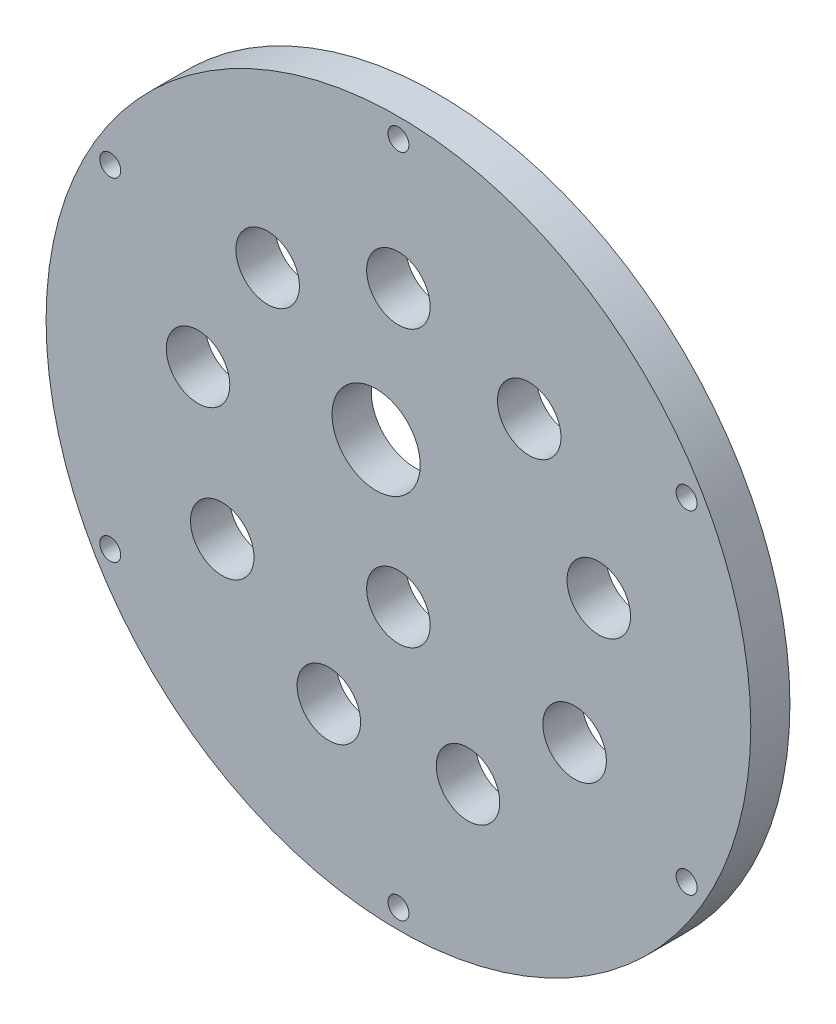
ISO-10303-21;
HEADER;
FILE_DESCRIPTION(('STEP AP214'),'2;1');
FILE_NAME('part.step','',(''),(''),'','','');
FILE_SCHEMA(('AUTOMOTIVE_DESIGN { 1 0 10303 214 1 1 1 1 }'));
ENDSEC;
DATA;
#1=APPLICATION_CONTEXT('core data for automotive mechanical design processes');
#2=APPLICATION_PROTOCOL_DEFINITION('international standard','automotive_design',2000,#1);
#3=PRODUCT_CONTEXT('',#1,'mechanical');
#4=PRODUCT('Part','Part','',(#3));
#5=PRODUCT_RELATED_PRODUCT_CATEGORY('part','',(#4));
#6=PRODUCT_DEFINITION_FORMATION('','',#4);
#7=PRODUCT_DEFINITION_CONTEXT('part definition',#1,'design');
#8=PRODUCT_DEFINITION('design','',#6,#7);
#9=PRODUCT_DEFINITION_SHAPE('','',#8);
#10=(LENGTH_UNIT() NAMED_UNIT(*) SI_UNIT(.MILLI.,.METRE.));
#11=(NAMED_UNIT(*) PLANE_ANGLE_UNIT() SI_UNIT($,.RADIAN.));
#12=(NAMED_UNIT(*) SI_UNIT($,.STERADIAN.) SOLID_ANGLE_UNIT());
#13=UNCERTAINTY_MEASURE_WITH_UNIT(LENGTH_MEASURE(1.E-05),#10,'distance_accuracy_value','');
#14=(GEOMETRIC_REPRESENTATION_CONTEXT(3) GLOBAL_UNCERTAINTY_ASSIGNED_CONTEXT((#13)) GLOBAL_UNIT_ASSIGNED_CONTEXT((#10,
#11,#12)) REPRESENTATION_CONTEXT('',''));
#15=CARTESIAN_POINT('',(0.,0.,0.));
#16=DIRECTION('',(0.,0.,1.));
#17=DIRECTION('',(1.,0.,0.));
#18=AXIS2_PLACEMENT_3D('',#15,#16,#17);
#19=CARTESIAN_POINT('',(0.,0.,6.35));
#20=DIRECTION('',(0.,0.,-1.));
#21=DIRECTION('',(-1.,0.,0.));
#22=AXIS2_PLACEMENT_3D('',#19,#20,#21);
#23=CYLINDRICAL_SURFACE('',#22,57.15);
#24=CARTESIAN_POINT('',(0.,0.,6.35));
#25=DIRECTION('',(0.,0.,1.));
#26=DIRECTION('',(1.,0.,0.));
#27=AXIS2_PLACEMENT_3D('',#24,#25,#26);
#28=CIRCLE('',#27,57.15);
#29=CARTESIAN_POINT('',(57.15,0.,6.35));
#30=VERTEX_POINT('',#29);
#31=EDGE_CURVE('E10',#30,#30,#28,.T.);
#32=ORIENTED_EDGE('',*,*,#31,.F.);
#33=EDGE_LOOP('',(#32));
#34=FACE_BOUND('',#33,.T.);
#35=CARTESIAN_POINT('',(0.,0.,0.));
#36=DIRECTION('',(0.,0.,1.));
#37=DIRECTION('',(1.,0.,0.));
#38=AXIS2_PLACEMENT_3D('',#35,#36,#37);
#39=CIRCLE('',#38,57.15);
#40=CARTESIAN_POINT('',(57.15,0.,0.));
#41=VERTEX_POINT('',#40);
#42=EDGE_CURVE('E43',#41,#41,#39,.T.);
#43=ORIENTED_EDGE('',*,*,#42,.T.);
#44=EDGE_LOOP('',(#43));
#45=FACE_BOUND('',#44,.T.);
#46=ADVANCED_FACE('F40',(#34,#45),#23,.T.);
#47=CARTESIAN_POINT('',(0.,0.,6.35));
#48=DIRECTION('',(0.,0.,1.));
#49=DIRECTION('',(1.,0.,0.));
#50=AXIS2_PLACEMENT_3D('',#47,#48,#49);
#51=PLANE('',#50);
#52=CARTESIAN_POINT('',(-3.61618795792426,9.93539475890081,6.35));
#53=DIRECTION('',(0.,0.,1.));
#54=DIRECTION('',(1.,0.,0.));
#55=AXIS2_PLACEMENT_3D('',#52,#53,#54);
#56=CIRCLE('',#55,7.15);
#57=CARTESIAN_POINT('',(3.53381204207574,9.93539475890081,6.35));
#58=VERTEX_POINT('',#57);
#59=EDGE_CURVE('E148',#58,#58,#56,.T.);
#60=ORIENTED_EDGE('',*,*,#59,.F.);
#61=EDGE_LOOP('',(#60));
#62=FACE_BOUND('',#61,.T.);
#63=CARTESIAN_POINT('',(0.,-11.7529526489722,6.35));
#64=DIRECTION('',(0.,0.,1.));
#65=DIRECTION('',(1.,0.,0.));
#66=AXIS2_PLACEMENT_3D('',#63,#64,#65);
#67=CIRCLE('',#66,5.15);
#68=CARTESIAN_POINT('',(5.14999999999992,-11.7529526489722,6.35));
#69=VERTEX_POINT('',#68);
#70=EDGE_CURVE('E142',#69,#69,#67,.T.);
#71=ORIENTED_EDGE('',*,*,#70,.F.);
#72=EDGE_LOOP('',(#71));
#73=FACE_BOUND('',#72,.T.);
#74=CARTESIAN_POINT('',(-46.7437211692648,26.9875000000005,6.35));
#75=DIRECTION('',(0.,0.,1.));
#76=DIRECTION('',(0.50000000000001,0.866025403784433,0.));
#77=AXIS2_PLACEMENT_3D('',#74,#75,#76);
#78=CIRCLE('',#77,1.7);
#79=CARTESIAN_POINT('',(-45.8937211692647,28.4597431864341,6.35));
#80=VERTEX_POINT('',#79);
#81=EDGE_CURVE('E118',#80,#80,#78,.T.);
#82=ORIENTED_EDGE('',*,*,#81,.F.);
#83=EDGE_LOOP('',(#82));
#84=FACE_BOUND('',#83,.T.);
#85=CARTESIAN_POINT('',(-46.7437211692653,-26.9874999999996,6.35));
#86=DIRECTION('',(0.,0.,1.));
#87=DIRECTION('',(-0.499999999999992,0.866025403784443,0.));
#88=AXIS2_PLACEMENT_3D('',#85,#86,#87);
#89=CIRCLE('',#88,1.7);
#90=CARTESIAN_POINT('',(-47.5937211692653,-25.515256813566,6.35));
#91=VERTEX_POINT('',#90);
#92=EDGE_CURVE('E125',#91,#91,#89,.T.);
#93=ORIENTED_EDGE('',*,*,#92,.F.);
#94=EDGE_LOOP('',(#93));
#95=FACE_BOUND('',#94,.T.);
#96=CARTESIAN_POINT('',(0.,-53.975,6.35));
#97=DIRECTION('',(0.,0.,1.));
#98=DIRECTION('',(-1.,0.,0.));
#99=AXIS2_PLACEMENT_3D('',#96,#97,#98);
#100=CIRCLE('',#99,1.7);
#101=CARTESIAN_POINT('',(-1.7,-53.975,6.35));
#102=VERTEX_POINT('',#101);
#103=EDGE_CURVE('E131',#102,#102,#100,.T.);
#104=ORIENTED_EDGE('',*,*,#103,.F.);
#105=EDGE_LOOP('',(#104));
#106=FACE_BOUND('',#105,.T.);
#107=CARTESIAN_POINT('',(46.743721169265,-26.9875000000002,6.35));
#108=DIRECTION('',(0.,0.,1.));
#109=DIRECTION('',(-0.500000000000004,-0.866025403784436,0.));
#110=AXIS2_PLACEMENT_3D('',#107,#108,#109);
#111=CIRCLE('',#110,1.7);
#112=CARTESIAN_POINT('',(45.893721169265,-28.4597431864338,6.35));
#113=VERTEX_POINT('',#112);
#114=EDGE_CURVE('E137',#113,#113,#111,.T.);
#115=ORIENTED_EDGE('',*,*,#114,.F.);
#116=EDGE_LOOP('',(#115));
#117=FACE_BOUND('',#116,.T.);
#118=CARTESIAN_POINT('',(46.7437211692651,26.9874999999999,6.35));
#119=DIRECTION('',(0.,0.,1.));
#120=DIRECTION('',(0.499999999999998,-0.86602540378444,0.));
#121=AXIS2_PLACEMENT_3D('',#118,#119,#120);
#122=CIRCLE('',#121,1.7);
#123=CARTESIAN_POINT('',(47.5937211692651,25.5152568135663,6.35));
#124=VERTEX_POINT('',#123);
#125=EDGE_CURVE('E112',#124,#124,#122,.T.);
#126=ORIENTED_EDGE('',*,*,#125,.F.);
#127=EDGE_LOOP('',(#126));
#128=FACE_BOUND('',#127,.T.);
#129=CARTESIAN_POINT('',(0.,53.975,6.35));
#130=DIRECTION('',(0.,0.,1.));
#131=DIRECTION('',(1.,0.,0.));
#132=AXIS2_PLACEMENT_3D('',#129,#130,#131);
#133=CIRCLE('',#132,1.7);
#134=CARTESIAN_POINT('',(1.7,53.975,6.35));
#135=VERTEX_POINT('',#134);
#136=EDGE_CURVE('E106',#135,#135,#133,.T.);
#137=ORIENTED_EDGE('',*,*,#136,.F.);
#138=EDGE_LOOP('',(#137));
#139=FACE_BOUND('',#138,.T.);
#140=CARTESIAN_POINT('',(32.4986558494029,5.7303898630086,6.35));
#141=DIRECTION('',(0.,0.,1.));
#142=DIRECTION('',(0.173648177666927,-0.984807753012209,0.));
#143=AXIS2_PLACEMENT_3D('',#140,#141,#142);
#144=CIRCLE('',#143,5.15);
#145=CARTESIAN_POINT('',(33.3929439643876,0.658629934995728,6.35));
#146=VERTEX_POINT('',#145);
#147=EDGE_CURVE('E83',#146,#146,#144,.T.);
#148=ORIENTED_EDGE('',*,*,#147,.F.);
#149=EDGE_LOOP('',(#148));
#150=FACE_BOUND('',#149,.T.);
#151=CARTESIAN_POINT('',(28.5788383248864,-16.5000000000001,6.35));
#152=DIRECTION('',(0.,0.,1.));
#153=DIRECTION('',(-0.500000000000004,-0.866025403784436,0.));
#154=AXIS2_PLACEMENT_3D('',#151,#152,#153);
#155=CIRCLE('',#154,5.15);
#156=CARTESIAN_POINT('',(26.0038383248864,-20.96003082949,6.35));
#157=VERTEX_POINT('',#156);
#158=EDGE_CURVE('E77',#157,#157,#155,.T.);
#159=ORIENTED_EDGE('',*,*,#158,.F.);
#160=EDGE_LOOP('',(#159));
#161=FACE_BOUND('',#160,.T.);
#162=CARTESIAN_POINT('',(11.2866647297469,-31.0098564859351,6.35));
#163=DIRECTION('',(0.,0.,1.));
#164=DIRECTION('',(-0.939692620785911,-0.342020143325663,0.));
#165=AXIS2_PLACEMENT_3D('',#162,#163,#164);
#166=CIRCLE('',#165,5.15);
#167=CARTESIAN_POINT('',(6.44724773269944,-32.7712602240622,6.35));
#168=VERTEX_POINT('',#167);
#169=EDGE_CURVE('E71',#168,#168,#166,.T.);
#170=ORIENTED_EDGE('',*,*,#169,.F.);
#171=EDGE_LOOP('',(#170));
#172=FACE_BOUND('',#171,.T.);
#173=CARTESIAN_POINT('',(-11.2866647297473,-31.0098564859349,6.35));
#174=DIRECTION('',(0.,0.,1.));
#175=DIRECTION('',(-0.939692620785906,0.342020143325676,0.));
#176=AXIS2_PLACEMENT_3D('',#173,#174,#175);
#177=CIRCLE('',#176,5.15);
#178=CARTESIAN_POINT('',(-16.1260817267947,-29.2484527478077,6.35));
#179=VERTEX_POINT('',#178);
#180=EDGE_CURVE('E64',#179,#179,#177,.T.);
#181=ORIENTED_EDGE('',*,*,#180,.F.);
#182=EDGE_LOOP('',(#181));
#183=FACE_BOUND('',#182,.T.);
#184=CARTESIAN_POINT('',(-28.5788383248866,-16.4999999999997,6.35));
#185=DIRECTION('',(0.,0.,1.));
#186=DIRECTION('',(-0.499999999999992,0.866025403784443,0.));
#187=AXIS2_PLACEMENT_3D('',#184,#185,#186);
#188=CIRCLE('',#187,5.15);
#189=CARTESIAN_POINT('',(-31.1538383248866,-12.0399691705099,6.35));
#190=VERTEX_POINT('',#189);
#191=EDGE_CURVE('E101',#190,#190,#188,.T.);
#192=ORIENTED_EDGE('',*,*,#191,.F.);
#193=EDGE_LOOP('',(#192));
#194=FACE_BOUND('',#193,.T.);
#195=CARTESIAN_POINT('',(-32.4986558494028,5.73038986300904,6.35));
#196=DIRECTION('',(0.,0.,1.));
#197=DIRECTION('',(0.17364817766694,0.984807753012206,0.));
#198=AXIS2_PLACEMENT_3D('',#195,#196,#197);
#199=CIRCLE('',#198,5.15);
#200=CARTESIAN_POINT('',(-31.6043677344181,10.8021497910219,6.35));
#201=VERTEX_POINT('',#200);
#202=EDGE_CURVE('E95',#201,#201,#199,.T.);
#203=ORIENTED_EDGE('',*,*,#202,.F.);
#204=EDGE_LOOP('',(#203));
#205=FACE_BOUND('',#204,.T.);
#206=CARTESIAN_POINT('',(-21.2119911196555,25.2794666229265,6.35));
#207=DIRECTION('',(0.,0.,1.));
#208=DIRECTION('',(0.766044443118986,0.64278760968653,0.));
#209=AXIS2_PLACEMENT_3D('',#206,#207,#208);
#210=CIRCLE('',#209,5.15);
#211=CARTESIAN_POINT('',(-17.2668622375927,28.5898228128122,6.35));
#212=VERTEX_POINT('',#211);
#213=EDGE_CURVE('E88',#212,#212,#210,.T.);
#214=ORIENTED_EDGE('',*,*,#213,.F.);
#215=EDGE_LOOP('',(#214));
#216=FACE_BOUND('',#215,.T.);
#217=CARTESIAN_POINT('',(21.2119911196558,25.2794666229263,6.35));
#218=DIRECTION('',(0.,0.,1.));
#219=DIRECTION('',(0.766044443118977,-0.642787609686541,0.));
#220=AXIS2_PLACEMENT_3D('',#217,#218,#219);
#221=CIRCLE('',#220,5.15);
#222=CARTESIAN_POINT('',(25.1571200017186,21.9691104330406,6.35));
#223=VERTEX_POINT('',#222);
#224=EDGE_CURVE('E58',#223,#223,#221,.T.);
#225=ORIENTED_EDGE('',*,*,#224,.F.);
#226=EDGE_LOOP('',(#225));
#227=FACE_BOUND('',#226,.T.);
#228=CARTESIAN_POINT('',(0.,33.,6.35));
#229=DIRECTION('',(0.,0.,1.));
#230=DIRECTION('',(1.,0.,0.));
#231=AXIS2_PLACEMENT_3D('',#228,#229,#230);
#232=CIRCLE('',#231,5.15);
#233=CARTESIAN_POINT('',(5.15,33.,6.35));
#234=VERTEX_POINT('',#233);
#235=EDGE_CURVE('E52',#234,#234,#232,.T.);
#236=ORIENTED_EDGE('',*,*,#235,.F.);
#237=EDGE_LOOP('',(#236));
#238=FACE_BOUND('',#237,.T.);
#239=ORIENTED_EDGE('',*,*,#31,.T.);
#240=EDGE_LOOP('',(#239));
#241=FACE_BOUND('',#240,.T.);
#242=ADVANCED_FACE('F164',(#62,#73,#84,#95,#106,#117,#128,#139,#150,#161,#172,#183,#194,#205,
#216,#227,#238,#241),#51,.T.);
#243=CARTESIAN_POINT('',(0.,0.,0.));
#244=DIRECTION('',(0.,0.,1.));
#245=DIRECTION('',(1.,0.,0.));
#246=AXIS2_PLACEMENT_3D('',#243,#244,#245);
#247=PLANE('',#246);
#248=CARTESIAN_POINT('',(-3.61618795792426,9.93539475890081,0.));
#249=DIRECTION('',(0.,0.,1.));
#250=DIRECTION('',(1.,0.,0.));
#251=AXIS2_PLACEMENT_3D('',#248,#249,#250);
#252=CIRCLE('',#251,7.15);
#253=CARTESIAN_POINT('',(3.53381204207574,9.93539475890081,0.));
#254=VERTEX_POINT('',#253);
#255=EDGE_CURVE('E122',#254,#254,#252,.T.);
#256=ORIENTED_EDGE('',*,*,#255,.T.);
#257=EDGE_LOOP('',(#256));
#258=FACE_BOUND('',#257,.T.);
#259=CARTESIAN_POINT('',(0.,-11.7529526489722,0.));
#260=DIRECTION('',(0.,0.,1.));
#261=DIRECTION('',(1.,0.,0.));
#262=AXIS2_PLACEMENT_3D('',#259,#260,#261);
#263=CIRCLE('',#262,5.15);
#264=CARTESIAN_POINT('',(5.14999999999992,-11.7529526489722,0.));
#265=VERTEX_POINT('',#264);
#266=EDGE_CURVE('E145',#265,#265,#263,.T.);
#267=ORIENTED_EDGE('',*,*,#266,.T.);
#268=EDGE_LOOP('',(#267));
#269=FACE_BOUND('',#268,.T.);
#270=CARTESIAN_POINT('',(-46.7437211692648,26.9875000000005,0.));
#271=DIRECTION('',(0.,0.,1.));
#272=DIRECTION('',(0.50000000000001,0.866025403784433,0.));
#273=AXIS2_PLACEMENT_3D('',#270,#271,#272);
#274=CIRCLE('',#273,1.7);
#275=CARTESIAN_POINT('',(-45.8937211692647,28.4597431864341,0.));
#276=VERTEX_POINT('',#275);
#277=EDGE_CURVE('E121',#276,#276,#274,.T.);
#278=ORIENTED_EDGE('',*,*,#277,.T.);
#279=EDGE_LOOP('',(#278));
#280=FACE_BOUND('',#279,.T.);
#281=CARTESIAN_POINT('',(-46.7437211692653,-26.9874999999996,0.));
#282=DIRECTION('',(0.,0.,1.));
#283=DIRECTION('',(-0.499999999999992,0.866025403784443,0.));
#284=AXIS2_PLACEMENT_3D('',#281,#282,#283);
#285=CIRCLE('',#284,1.7);
#286=CARTESIAN_POINT('',(-47.5937211692653,-25.515256813566,0.));
#287=VERTEX_POINT('',#286);
#288=EDGE_CURVE('E128',#287,#287,#285,.T.);
#289=ORIENTED_EDGE('',*,*,#288,.T.);
#290=EDGE_LOOP('',(#289));
#291=FACE_BOUND('',#290,.T.);
#292=CARTESIAN_POINT('',(0.,-53.975,0.));
#293=DIRECTION('',(0.,0.,1.));
#294=DIRECTION('',(-1.,0.,0.));
#295=AXIS2_PLACEMENT_3D('',#292,#293,#294);
#296=CIRCLE('',#295,1.7);
#297=CARTESIAN_POINT('',(-1.7,-53.975,0.));
#298=VERTEX_POINT('',#297);
#299=EDGE_CURVE('E134',#298,#298,#296,.T.);
#300=ORIENTED_EDGE('',*,*,#299,.T.);
#301=EDGE_LOOP('',(#300));
#302=FACE_BOUND('',#301,.T.);
#303=CARTESIAN_POINT('',(46.743721169265,-26.9875000000002,0.));
#304=DIRECTION('',(0.,0.,1.));
#305=DIRECTION('',(-0.500000000000004,-0.866025403784436,0.));
#306=AXIS2_PLACEMENT_3D('',#303,#304,#305);
#307=CIRCLE('',#306,1.7);
#308=CARTESIAN_POINT('',(45.893721169265,-28.4597431864338,0.));
#309=VERTEX_POINT('',#308);
#310=EDGE_CURVE('E115',#309,#309,#307,.T.);
#311=ORIENTED_EDGE('',*,*,#310,.T.);
#312=EDGE_LOOP('',(#311));
#313=FACE_BOUND('',#312,.T.);
#314=CARTESIAN_POINT('',(46.7437211692651,26.9874999999999,0.));
#315=DIRECTION('',(0.,0.,1.));
#316=DIRECTION('',(0.499999999999998,-0.86602540378444,0.));
#317=AXIS2_PLACEMENT_3D('',#314,#315,#316);
#318=CIRCLE('',#317,1.7);
#319=CARTESIAN_POINT('',(47.5937211692651,25.5152568135663,0.));
#320=VERTEX_POINT('',#319);
#321=EDGE_CURVE('E109',#320,#320,#318,.T.);
#322=ORIENTED_EDGE('',*,*,#321,.T.);
#323=EDGE_LOOP('',(#322));
#324=FACE_BOUND('',#323,.T.);
#325=CARTESIAN_POINT('',(0.,53.975,0.));
#326=DIRECTION('',(0.,0.,1.));
#327=DIRECTION('',(1.,0.,0.));
#328=AXIS2_PLACEMENT_3D('',#325,#326,#327);
#329=CIRCLE('',#328,1.7);
#330=CARTESIAN_POINT('',(1.7,53.975,0.));
#331=VERTEX_POINT('',#330);
#332=EDGE_CURVE('E92',#331,#331,#329,.T.);
#333=ORIENTED_EDGE('',*,*,#332,.T.);
#334=EDGE_LOOP('',(#333));
#335=FACE_BOUND('',#334,.T.);
#336=CARTESIAN_POINT('',(32.4986558494029,5.7303898630086,0.));
#337=DIRECTION('',(0.,0.,1.));
#338=DIRECTION('',(0.173648177666927,-0.984807753012209,0.));
#339=AXIS2_PLACEMENT_3D('',#336,#337,#338);
#340=CIRCLE('',#339,5.15);
#341=CARTESIAN_POINT('',(33.3929439643876,0.658629934995728,0.));
#342=VERTEX_POINT('',#341);
#343=EDGE_CURVE('E61',#342,#342,#340,.T.);
#344=ORIENTED_EDGE('',*,*,#343,.T.);
#345=EDGE_LOOP('',(#344));
#346=FACE_BOUND('',#345,.T.);
#347=CARTESIAN_POINT('',(28.5788383248864,-16.5000000000001,0.));
#348=DIRECTION('',(0.,0.,1.));
#349=DIRECTION('',(-0.500000000000004,-0.866025403784436,0.));
#350=AXIS2_PLACEMENT_3D('',#347,#348,#349);
#351=CIRCLE('',#350,5.15);
#352=CARTESIAN_POINT('',(26.0038383248864,-20.96003082949,0.));
#353=VERTEX_POINT('',#352);
#354=EDGE_CURVE('E80',#353,#353,#351,.T.);
#355=ORIENTED_EDGE('',*,*,#354,.T.);
#356=EDGE_LOOP('',(#355));
#357=FACE_BOUND('',#356,.T.);
#358=CARTESIAN_POINT('',(11.2866647297469,-31.0098564859351,0.));
#359=DIRECTION('',(0.,0.,1.));
#360=DIRECTION('',(-0.939692620785911,-0.342020143325663,0.));
#361=AXIS2_PLACEMENT_3D('',#358,#359,#360);
#362=CIRCLE('',#361,5.15);
#363=CARTESIAN_POINT('',(6.44724773269944,-32.7712602240622,0.));
#364=VERTEX_POINT('',#363);
#365=EDGE_CURVE('E74',#364,#364,#362,.T.);
#366=ORIENTED_EDGE('',*,*,#365,.T.);
#367=EDGE_LOOP('',(#366));
#368=FACE_BOUND('',#367,.T.);
#369=CARTESIAN_POINT('',(-11.2866647297473,-31.0098564859349,0.));
#370=DIRECTION('',(0.,0.,1.));
#371=DIRECTION('',(-0.939692620785906,0.342020143325676,0.));
#372=AXIS2_PLACEMENT_3D('',#369,#370,#371);
#373=CIRCLE('',#372,5.15);
#374=CARTESIAN_POINT('',(-16.1260817267947,-29.2484527478077,0.));
#375=VERTEX_POINT('',#374);
#376=EDGE_CURVE('E67',#375,#375,#373,.T.);
#377=ORIENTED_EDGE('',*,*,#376,.T.);
#378=EDGE_LOOP('',(#377));
#379=FACE_BOUND('',#378,.T.);
#380=CARTESIAN_POINT('',(-28.5788383248866,-16.4999999999997,0.));
#381=DIRECTION('',(0.,0.,1.));
#382=DIRECTION('',(-0.499999999999992,0.866025403784443,0.));
#383=AXIS2_PLACEMENT_3D('',#380,#381,#382);
#384=CIRCLE('',#383,5.15);
#385=CARTESIAN_POINT('',(-31.1538383248866,-12.0399691705099,0.));
#386=VERTEX_POINT('',#385);
#387=EDGE_CURVE('E68',#386,#386,#384,.T.);
#388=ORIENTED_EDGE('',*,*,#387,.T.);
#389=EDGE_LOOP('',(#388));
#390=FACE_BOUND('',#389,.T.);
#391=CARTESIAN_POINT('',(-32.4986558494028,5.73038986300904,0.));
#392=DIRECTION('',(0.,0.,1.));
#393=DIRECTION('',(0.17364817766694,0.984807753012206,0.));
#394=AXIS2_PLACEMENT_3D('',#391,#392,#393);
#395=CIRCLE('',#394,5.15);
#396=CARTESIAN_POINT('',(-31.6043677344181,10.8021497910219,0.));
#397=VERTEX_POINT('',#396);
#398=EDGE_CURVE('E98',#397,#397,#395,.T.);
#399=ORIENTED_EDGE('',*,*,#398,.T.);
#400=EDGE_LOOP('',(#399));
#401=FACE_BOUND('',#400,.T.);
#402=CARTESIAN_POINT('',(-21.2119911196555,25.2794666229265,0.));
#403=DIRECTION('',(0.,0.,1.));
#404=DIRECTION('',(0.766044443118986,0.64278760968653,0.));
#405=AXIS2_PLACEMENT_3D('',#402,#403,#404);
#406=CIRCLE('',#405,5.15);
#407=CARTESIAN_POINT('',(-17.2668622375927,28.5898228128122,0.));
#408=VERTEX_POINT('',#407);
#409=EDGE_CURVE('E91',#408,#408,#406,.T.);
#410=ORIENTED_EDGE('',*,*,#409,.T.);
#411=EDGE_LOOP('',(#410));
#412=FACE_BOUND('',#411,.T.);
#413=CARTESIAN_POINT('',(21.2119911196558,25.2794666229263,0.));
#414=DIRECTION('',(0.,0.,1.));
#415=DIRECTION('',(0.766044443118977,-0.642787609686541,0.));
#416=AXIS2_PLACEMENT_3D('',#413,#414,#415);
#417=CIRCLE('',#416,5.15);
#418=CARTESIAN_POINT('',(25.1571200017186,21.9691104330406,0.));
#419=VERTEX_POINT('',#418);
#420=EDGE_CURVE('E55',#419,#419,#417,.T.);
#421=ORIENTED_EDGE('',*,*,#420,.T.);
#422=EDGE_LOOP('',(#421));
#423=FACE_BOUND('',#422,.T.);
#424=CARTESIAN_POINT('',(0.,33.,0.));
#425=DIRECTION('',(0.,0.,1.));
#426=DIRECTION('',(1.,0.,0.));
#427=AXIS2_PLACEMENT_3D('',#424,#425,#426);
#428=CIRCLE('',#427,5.15);
#429=CARTESIAN_POINT('',(5.15,33.,0.));
#430=VERTEX_POINT('',#429);
#431=EDGE_CURVE('E50',#430,#430,#428,.T.);
#432=ORIENTED_EDGE('',*,*,#431,.T.);
#433=EDGE_LOOP('',(#432));
#434=FACE_BOUND('',#433,.T.);
#435=ORIENTED_EDGE('',*,*,#42,.F.);
#436=EDGE_LOOP('',(#435));
#437=FACE_BOUND('',#436,.T.);
#438=ADVANCED_FACE('F154',(#258,#269,#280,#291,#302,#313,#324,#335,#346,#357,#368,#379,#390,
#401,#412,#423,#434,#437),#247,.F.);
#439=CARTESIAN_POINT('',(0.,33.,0.));
#440=DIRECTION('',(0.,0.,1.));
#441=DIRECTION('',(1.,0.,0.));
#442=AXIS2_PLACEMENT_3D('',#439,#440,#441);
#443=CYLINDRICAL_SURFACE('',#442,5.15);
#444=ORIENTED_EDGE('',*,*,#431,.F.);
#445=EDGE_LOOP('',(#444));
#446=FACE_BOUND('',#445,.T.);
#447=ORIENTED_EDGE('',*,*,#235,.T.);
#448=EDGE_LOOP('',(#447));
#449=FACE_BOUND('',#448,.T.);
#450=ADVANCED_FACE('F200',(#446,#449),#443,.F.);
#451=CARTESIAN_POINT('',(21.2119911196558,25.2794666229263,0.));
#452=DIRECTION('',(0.,0.,1.));
#453=DIRECTION('',(1.,0.,0.));
#454=AXIS2_PLACEMENT_3D('',#451,#452,#453);
#455=CYLINDRICAL_SURFACE('',#454,5.15);
#456=ORIENTED_EDGE('',*,*,#420,.F.);
#457=EDGE_LOOP('',(#456));
#458=FACE_BOUND('',#457,.T.);
#459=ORIENTED_EDGE('',*,*,#224,.T.);
#460=EDGE_LOOP('',(#459));
#461=FACE_BOUND('',#460,.T.);
#462=ADVANCED_FACE('F202',(#458,#461),#455,.F.);
#463=CARTESIAN_POINT('',(-21.2119911196555,25.2794666229265,0.));
#464=DIRECTION('',(0.,0.,1.));
#465=DIRECTION('',(1.,0.,0.));
#466=AXIS2_PLACEMENT_3D('',#463,#464,#465);
#467=CYLINDRICAL_SURFACE('',#466,5.15);
#468=ORIENTED_EDGE('',*,*,#409,.F.);
#469=EDGE_LOOP('',(#468));
#470=FACE_BOUND('',#469,.T.);
#471=ORIENTED_EDGE('',*,*,#213,.T.);
#472=EDGE_LOOP('',(#471));
#473=FACE_BOUND('',#472,.T.);
#474=ADVANCED_FACE('F209',(#470,#473),#467,.F.);
#475=CARTESIAN_POINT('',(-32.4986558494028,5.73038986300904,0.));
#476=DIRECTION('',(0.,0.,1.));
#477=DIRECTION('',(1.,0.,0.));
#478=AXIS2_PLACEMENT_3D('',#475,#476,#477);
#479=CYLINDRICAL_SURFACE('',#478,5.15);
#480=ORIENTED_EDGE('',*,*,#398,.F.);
#481=EDGE_LOOP('',(#480));
#482=FACE_BOUND('',#481,.T.);
#483=ORIENTED_EDGE('',*,*,#202,.T.);
#484=EDGE_LOOP('',(#483));
#485=FACE_BOUND('',#484,.T.);
#486=ADVANCED_FACE('F333',(#482,#485),#479,.F.);
#487=CARTESIAN_POINT('',(-28.5788383248866,-16.4999999999997,0.));
#488=DIRECTION('',(0.,0.,1.));
#489=DIRECTION('',(1.,0.,0.));
#490=AXIS2_PLACEMENT_3D('',#487,#488,#489);
#491=CYLINDRICAL_SURFACE('',#490,5.15);
#492=ORIENTED_EDGE('',*,*,#387,.F.);
#493=EDGE_LOOP('',(#492));
#494=FACE_BOUND('',#493,.T.);
#495=ORIENTED_EDGE('',*,*,#191,.T.);
#496=EDGE_LOOP('',(#495));
#497=FACE_BOUND('',#496,.T.);
#498=ADVANCED_FACE('F325',(#494,#497),#491,.F.);
#499=CARTESIAN_POINT('',(-11.2866647297473,-31.0098564859349,0.));
#500=DIRECTION('',(0.,0.,1.));
#501=DIRECTION('',(1.,0.,0.));
#502=AXIS2_PLACEMENT_3D('',#499,#500,#501);
#503=CYLINDRICAL_SURFACE('',#502,5.15);
#504=ORIENTED_EDGE('',*,*,#376,.F.);
#505=EDGE_LOOP('',(#504));
#506=FACE_BOUND('',#505,.T.);
#507=ORIENTED_EDGE('',*,*,#180,.T.);
#508=EDGE_LOOP('',(#507));
#509=FACE_BOUND('',#508,.T.);
#510=ADVANCED_FACE('F317',(#506,#509),#503,.F.);
#511=CARTESIAN_POINT('',(11.2866647297469,-31.0098564859351,0.));
#512=DIRECTION('',(0.,0.,1.));
#513=DIRECTION('',(1.,0.,0.));
#514=AXIS2_PLACEMENT_3D('',#511,#512,#513);
#515=CYLINDRICAL_SURFACE('',#514,5.15);
#516=ORIENTED_EDGE('',*,*,#365,.F.);
#517=EDGE_LOOP('',(#516));
#518=FACE_BOUND('',#517,.T.);
#519=ORIENTED_EDGE('',*,*,#169,.T.);
#520=EDGE_LOOP('',(#519));
#521=FACE_BOUND('',#520,.T.);
#522=ADVANCED_FACE('F309',(#518,#521),#515,.F.);
#523=CARTESIAN_POINT('',(28.5788383248864,-16.5000000000001,0.));
#524=DIRECTION('',(0.,0.,1.));
#525=DIRECTION('',(1.,0.,0.));
#526=AXIS2_PLACEMENT_3D('',#523,#524,#525);
#527=CYLINDRICAL_SURFACE('',#526,5.15);
#528=ORIENTED_EDGE('',*,*,#354,.F.);
#529=EDGE_LOOP('',(#528));
#530=FACE_BOUND('',#529,.T.);
#531=ORIENTED_EDGE('',*,*,#158,.T.);
#532=EDGE_LOOP('',(#531));
#533=FACE_BOUND('',#532,.T.);
#534=ADVANCED_FACE('F301',(#530,#533),#527,.F.);
#535=CARTESIAN_POINT('',(32.4986558494029,5.7303898630086,0.));
#536=DIRECTION('',(0.,0.,1.));
#537=DIRECTION('',(1.,0.,0.));
#538=AXIS2_PLACEMENT_3D('',#535,#536,#537);
#539=CYLINDRICAL_SURFACE('',#538,5.15);
#540=ORIENTED_EDGE('',*,*,#343,.F.);
#541=EDGE_LOOP('',(#540));
#542=FACE_BOUND('',#541,.T.);
#543=ORIENTED_EDGE('',*,*,#147,.T.);
#544=EDGE_LOOP('',(#543));
#545=FACE_BOUND('',#544,.T.);
#546=ADVANCED_FACE('F293',(#542,#545),#539,.F.);
#547=CARTESIAN_POINT('',(0.,53.975,0.));
#548=DIRECTION('',(0.,0.,1.));
#549=DIRECTION('',(1.,0.,0.));
#550=AXIS2_PLACEMENT_3D('',#547,#548,#549);
#551=CYLINDRICAL_SURFACE('',#550,1.7);
#552=ORIENTED_EDGE('',*,*,#332,.F.);
#553=EDGE_LOOP('',(#552));
#554=FACE_BOUND('',#553,.T.);
#555=ORIENTED_EDGE('',*,*,#136,.T.);
#556=EDGE_LOOP('',(#555));
#557=FACE_BOUND('',#556,.T.);
#558=ADVANCED_FACE('F285',(#554,#557),#551,.F.);
#559=CARTESIAN_POINT('',(46.7437211692651,26.9874999999999,0.));
#560=DIRECTION('',(0.,0.,1.));
#561=DIRECTION('',(1.,0.,0.));
#562=AXIS2_PLACEMENT_3D('',#559,#560,#561);
#563=CYLINDRICAL_SURFACE('',#562,1.7);
#564=ORIENTED_EDGE('',*,*,#321,.F.);
#565=EDGE_LOOP('',(#564));
#566=FACE_BOUND('',#565,.T.);
#567=ORIENTED_EDGE('',*,*,#125,.T.);
#568=EDGE_LOOP('',(#567));
#569=FACE_BOUND('',#568,.T.);
#570=ADVANCED_FACE('F277',(#566,#569),#563,.F.);
#571=CARTESIAN_POINT('',(46.743721169265,-26.9875000000002,0.));
#572=DIRECTION('',(0.,0.,1.));
#573=DIRECTION('',(1.,0.,0.));
#574=AXIS2_PLACEMENT_3D('',#571,#572,#573);
#575=CYLINDRICAL_SURFACE('',#574,1.7);
#576=ORIENTED_EDGE('',*,*,#310,.F.);
#577=EDGE_LOOP('',(#576));
#578=FACE_BOUND('',#577,.T.);
#579=ORIENTED_EDGE('',*,*,#114,.T.);
#580=EDGE_LOOP('',(#579));
#581=FACE_BOUND('',#580,.T.);
#582=ADVANCED_FACE('F269',(#578,#581),#575,.F.);
#583=CARTESIAN_POINT('',(0.,-53.975,0.));
#584=DIRECTION('',(0.,0.,1.));
#585=DIRECTION('',(1.,0.,0.));
#586=AXIS2_PLACEMENT_3D('',#583,#584,#585);
#587=CYLINDRICAL_SURFACE('',#586,1.7);
#588=ORIENTED_EDGE('',*,*,#299,.F.);
#589=EDGE_LOOP('',(#588));
#590=FACE_BOUND('',#589,.T.);
#591=ORIENTED_EDGE('',*,*,#103,.T.);
#592=EDGE_LOOP('',(#591));
#593=FACE_BOUND('',#592,.T.);
#594=ADVANCED_FACE('F261',(#590,#593),#587,.F.);
#595=CARTESIAN_POINT('',(-46.7437211692653,-26.9874999999996,0.));
#596=DIRECTION('',(0.,0.,1.));
#597=DIRECTION('',(1.,0.,0.));
#598=AXIS2_PLACEMENT_3D('',#595,#596,#597);
#599=CYLINDRICAL_SURFACE('',#598,1.7);
#600=ORIENTED_EDGE('',*,*,#288,.F.);
#601=EDGE_LOOP('',(#600));
#602=FACE_BOUND('',#601,.T.);
#603=ORIENTED_EDGE('',*,*,#92,.T.);
#604=EDGE_LOOP('',(#603));
#605=FACE_BOUND('',#604,.T.);
#606=ADVANCED_FACE('F254',(#602,#605),#599,.F.);
#607=CARTESIAN_POINT('',(-46.7437211692648,26.9875000000005,0.));
#608=DIRECTION('',(0.,0.,1.));
#609=DIRECTION('',(1.,0.,0.));
#610=AXIS2_PLACEMENT_3D('',#607,#608,#609);
#611=CYLINDRICAL_SURFACE('',#610,1.7);
#612=ORIENTED_EDGE('',*,*,#277,.F.);
#613=EDGE_LOOP('',(#612));
#614=FACE_BOUND('',#613,.T.);
#615=ORIENTED_EDGE('',*,*,#81,.T.);
#616=EDGE_LOOP('',(#615));
#617=FACE_BOUND('',#616,.T.);
#618=ADVANCED_FACE('F239',(#614,#617),#611,.F.);
#619=CARTESIAN_POINT('',(0.,-11.7529526489722,0.));
#620=DIRECTION('',(0.,0.,1.));
#621=DIRECTION('',(1.,0.,0.));
#622=AXIS2_PLACEMENT_3D('',#619,#620,#621);
#623=CYLINDRICAL_SURFACE('',#622,5.15);
#624=ORIENTED_EDGE('',*,*,#266,.F.);
#625=EDGE_LOOP('',(#624));
#626=FACE_BOUND('',#625,.T.);
#627=ORIENTED_EDGE('',*,*,#70,.T.);
#628=EDGE_LOOP('',(#627));
#629=FACE_BOUND('',#628,.T.);
#630=ADVANCED_FACE('F160',(#626,#629),#623,.F.);
#631=CARTESIAN_POINT('',(-3.61618795792426,9.93539475890081,0.));
#632=DIRECTION('',(0.,0.,1.));
#633=DIRECTION('',(1.,0.,0.));
#634=AXIS2_PLACEMENT_3D('',#631,#632,#633);
#635=CYLINDRICAL_SURFACE('',#634,7.15);
#636=ORIENTED_EDGE('',*,*,#255,.F.);
#637=EDGE_LOOP('',(#636));
#638=FACE_BOUND('',#637,.T.);
#639=ORIENTED_EDGE('',*,*,#59,.T.);
#640=EDGE_LOOP('',(#639));
#641=FACE_BOUND('',#640,.T.);
#642=ADVANCED_FACE('F157',(#638,#641),#635,.F.);
#643=CLOSED_SHELL('',(#46,#242,#438,#450,#462,#474,#486,#498,#510,#522,#534,#546,#558,#570,#582,
#594,#606,#618,#630,#642));
#644=MANIFOLD_SOLID_BREP('B2',#643);
#645=ADVANCED_BREP_SHAPE_REPRESENTATION('',(#18,#644),#14);
#646=SHAPE_DEFINITION_REPRESENTATION(#9,#645);
ENDSEC;
END-ISO-10303-21;
